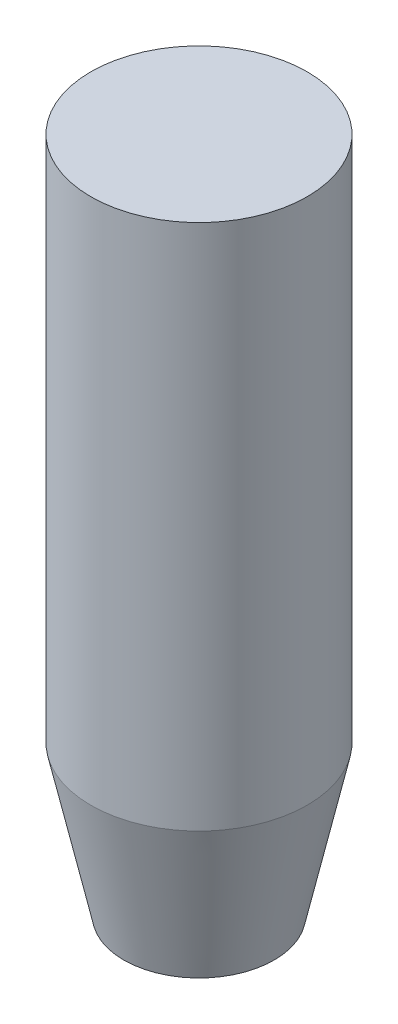
ISO-10303-21;
HEADER;
FILE_DESCRIPTION(('STEP AP214'),'2;1');
FILE_NAME('part.step','',(''),(''),'','','');
FILE_SCHEMA(('AUTOMOTIVE_DESIGN { 1 0 10303 214 1 1 1 1 }'));
ENDSEC;
DATA;
#1=APPLICATION_CONTEXT('core data for automotive mechanical design processes');
#2=APPLICATION_PROTOCOL_DEFINITION('international standard','automotive_design',2000,#1);
#3=PRODUCT_CONTEXT('',#1,'mechanical');
#4=PRODUCT('Part','Part','',(#3));
#5=PRODUCT_RELATED_PRODUCT_CATEGORY('part','',(#4));
#6=PRODUCT_DEFINITION_FORMATION('','',#4);
#7=PRODUCT_DEFINITION_CONTEXT('part definition',#1,'design');
#8=PRODUCT_DEFINITION('design','',#6,#7);
#9=PRODUCT_DEFINITION_SHAPE('','',#8);
#10=(LENGTH_UNIT() NAMED_UNIT(*) SI_UNIT(.MILLI.,.METRE.));
#11=(NAMED_UNIT(*) PLANE_ANGLE_UNIT() SI_UNIT($,.RADIAN.));
#12=(NAMED_UNIT(*) SI_UNIT($,.STERADIAN.) SOLID_ANGLE_UNIT());
#13=UNCERTAINTY_MEASURE_WITH_UNIT(LENGTH_MEASURE(1.E-05),#10,'distance_accuracy_value','');
#14=(GEOMETRIC_REPRESENTATION_CONTEXT(3) GLOBAL_UNCERTAINTY_ASSIGNED_CONTEXT((#13)) GLOBAL_UNIT_ASSIGNED_CONTEXT((#10,
#11,#12)) REPRESENTATION_CONTEXT('',''));
#15=CARTESIAN_POINT('',(0.,0.,0.));
#16=DIRECTION('',(0.,0.,1.));
#17=DIRECTION('',(1.,0.,0.));
#18=AXIS2_PLACEMENT_3D('',#15,#16,#17);
#19=CARTESIAN_POINT('',(0.,114.3,0.));
#20=DIRECTION('',(0.,-1.,0.));
#21=DIRECTION('',(0.,0.,-1.));
#22=AXIS2_PLACEMENT_3D('',#19,#20,#21);
#23=CYLINDRICAL_SURFACE('',#22,18.25625);
#24=CARTESIAN_POINT('',(0.,25.4000000000007,0.));
#25=DIRECTION('',(0.,1.,0.));
#26=DIRECTION('',(0.,0.,1.));
#27=AXIS2_PLACEMENT_3D('',#24,#25,#26);
#28=CIRCLE('',#27,18.25625);
#29=CARTESIAN_POINT('',(0.,25.4000000000007,18.25625));
#30=VERTEX_POINT('',#29);
#31=EDGE_CURVE('E39',#30,#30,#28,.T.);
#32=ORIENTED_EDGE('',*,*,#31,.T.);
#33=EDGE_LOOP('',(#32));
#34=FACE_BOUND('',#33,.T.);
#35=CARTESIAN_POINT('',(0.,114.3,0.));
#36=DIRECTION('',(0.,1.,0.));
#37=DIRECTION('',(0.,0.,1.));
#38=AXIS2_PLACEMENT_3D('',#35,#36,#37);
#39=CIRCLE('',#38,18.25625);
#40=CARTESIAN_POINT('',(0.,114.3,18.25625));
#41=VERTEX_POINT('',#40);
#42=EDGE_CURVE('E43',#41,#41,#39,.T.);
#43=ORIENTED_EDGE('',*,*,#42,.F.);
#44=EDGE_LOOP('',(#43));
#45=FACE_BOUND('',#44,.T.);
#46=ADVANCED_FACE('F32',(#34,#45),#23,.T.);
#47=CARTESIAN_POINT('',(0.,114.3,0.));
#48=DIRECTION('',(0.,1.,0.));
#49=DIRECTION('',(0.,0.,1.));
#50=AXIS2_PLACEMENT_3D('',#47,#48,#49);
#51=PLANE('',#50);
#52=ORIENTED_EDGE('',*,*,#42,.T.);
#53=EDGE_LOOP('',(#52));
#54=FACE_BOUND('',#53,.T.);
#55=ADVANCED_FACE('F50',(#54),#51,.T.);
#56=CARTESIAN_POINT('',(0.,0.,0.));
#57=DIRECTION('',(0.,1.,0.));
#58=DIRECTION('',(0.,0.,1.));
#59=AXIS2_PLACEMENT_3D('',#56,#57,#58);
#60=PLANE('',#59);
#61=CARTESIAN_POINT('',(0.,0.,0.));
#62=DIRECTION('',(0.,1.,0.));
#63=DIRECTION('',(0.,0.,1.));
#64=AXIS2_PLACEMENT_3D('',#61,#62,#63);
#65=CIRCLE('',#64,12.6999999999999);
#66=CARTESIAN_POINT('',(0.,0.,12.6999999999999));
#67=VERTEX_POINT('',#66);
#68=EDGE_CURVE('E10',#67,#67,#65,.F.);
#69=ORIENTED_EDGE('',*,*,#68,.T.);
#70=EDGE_LOOP('',(#69));
#71=FACE_BOUND('',#70,.T.);
#72=ADVANCED_FACE('F56',(#71),#60,.F.);
#73=CARTESIAN_POINT('',(0.,25.4000000000007,0.));
#74=DIRECTION('',(0.,1.,0.));
#75=DIRECTION('',(0.,0.,1.));
#76=AXIS2_PLACEMENT_3D('',#73,#74,#75);
#77=CONICAL_SURFACE('',#76,18.25625,0.215357699697735);
#78=ORIENTED_EDGE('',*,*,#68,.F.);
#79=EDGE_LOOP('',(#78));
#80=FACE_BOUND('',#79,.T.);
#81=ORIENTED_EDGE('',*,*,#31,.F.);
#82=EDGE_LOOP('',(#81));
#83=FACE_BOUND('',#82,.T.);
#84=ADVANCED_FACE('F34',(#80,#83),#77,.T.);
#85=CLOSED_SHELL('',(#46,#55,#72,#84));
#86=MANIFOLD_SOLID_BREP('B2',#85);
#87=ADVANCED_BREP_SHAPE_REPRESENTATION('',(#18,#86),#14);
#88=SHAPE_DEFINITION_REPRESENTATION(#9,#87);
ENDSEC;
END-ISO-10303-21;
